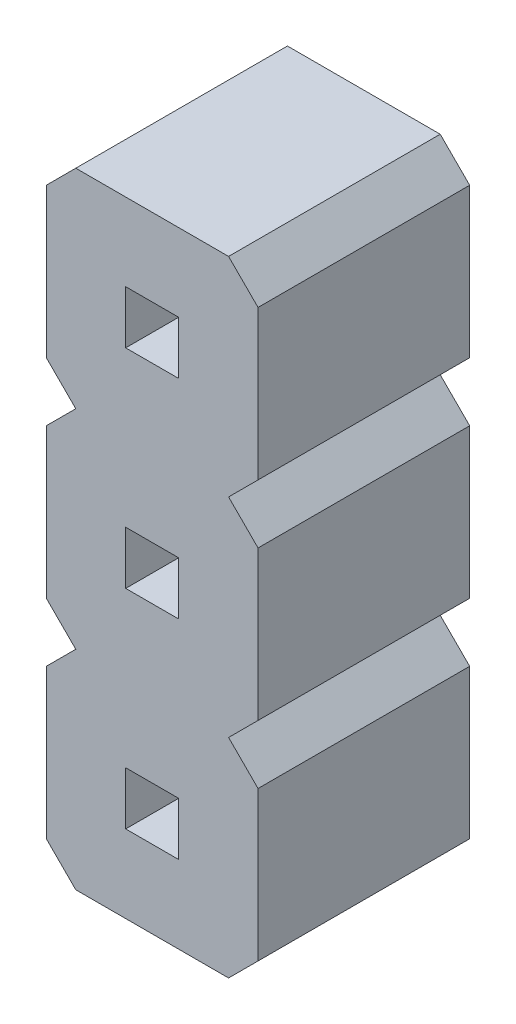
ISO-10303-21;
HEADER;
FILE_DESCRIPTION(('STEP AP214'),'2;1');
FILE_NAME('part.step','',(''),(''),'','','');
FILE_SCHEMA(('AUTOMOTIVE_DESIGN { 1 0 10303 214 1 1 1 1 }'));
ENDSEC;
DATA;
#1=APPLICATION_CONTEXT('core data for automotive mechanical design processes');
#2=APPLICATION_PROTOCOL_DEFINITION('international standard','automotive_design',2000,#1);
#3=PRODUCT_CONTEXT('',#1,'mechanical');
#4=PRODUCT('Part','Part','',(#3));
#5=PRODUCT_RELATED_PRODUCT_CATEGORY('part','',(#4));
#6=PRODUCT_DEFINITION_FORMATION('','',#4);
#7=PRODUCT_DEFINITION_CONTEXT('part definition',#1,'design');
#8=PRODUCT_DEFINITION('design','',#6,#7);
#9=PRODUCT_DEFINITION_SHAPE('','',#8);
#10=(LENGTH_UNIT() NAMED_UNIT(*) SI_UNIT(.MILLI.,.METRE.));
#11=(NAMED_UNIT(*) PLANE_ANGLE_UNIT() SI_UNIT($,.RADIAN.));
#12=(NAMED_UNIT(*) SI_UNIT($,.STERADIAN.) SOLID_ANGLE_UNIT());
#13=UNCERTAINTY_MEASURE_WITH_UNIT(LENGTH_MEASURE(1.E-05),#10,'distance_accuracy_value','');
#14=(GEOMETRIC_REPRESENTATION_CONTEXT(3) GLOBAL_UNCERTAINTY_ASSIGNED_CONTEXT((#13)) GLOBAL_UNIT_ASSIGNED_CONTEXT((#10,
#11,#12)) REPRESENTATION_CONTEXT('',''));
#15=CARTESIAN_POINT('',(0.,0.,0.));
#16=DIRECTION('',(0.,0.,1.));
#17=DIRECTION('',(1.,0.,0.));
#18=AXIS2_PLACEMENT_3D('',#15,#16,#17);
#19=CARTESIAN_POINT('',(0.,0.,2.54));
#20=DIRECTION('',(0.,0.,1.));
#21=DIRECTION('',(1.,0.,0.));
#22=AXIS2_PLACEMENT_3D('',#19,#20,#21);
#23=PLANE('',#22);
#24=DIRECTION('',(-0.707106781186543,-0.707106781186552,0.));
#25=VECTOR('',#24,1.);
#26=CARTESIAN_POINT('',(0.,-0.353553390593276,2.54));
#27=LINE('',#26,#25);
#28=CARTESIAN_POINT('',(0.353553390593274,0.,2.54));
#29=VERTEX_POINT('',#28);
#30=CARTESIAN_POINT('',(0.,-0.353553390593276,2.54));
#31=VERTEX_POINT('',#30);
#32=EDGE_CURVE('E340',#29,#31,#27,.T.);
#33=ORIENTED_EDGE('',*,*,#32,.T.);
#34=DIRECTION('',(0.,-1.,0.));
#35=VECTOR('',#34,1.);
#36=CARTESIAN_POINT('',(0.,-0.353553390593276,2.54));
#37=LINE('',#36,#35);
#38=CARTESIAN_POINT('',(0.,-2.14644660940673,2.54));
#39=VERTEX_POINT('',#38);
#40=EDGE_CURVE('E343',#31,#39,#37,.T.);
#41=ORIENTED_EDGE('',*,*,#40,.T.);
#42=DIRECTION('',(0.707106781186551,-0.707106781186544,0.));
#43=VECTOR('',#42,1.);
#44=CARTESIAN_POINT('',(0.353553390593274,-2.5,2.54));
#45=LINE('',#44,#43);
#46=CARTESIAN_POINT('',(0.353553390593274,-2.5,2.54));
#47=VERTEX_POINT('',#46);
#48=EDGE_CURVE('E346',#39,#47,#45,.T.);
#49=ORIENTED_EDGE('',*,*,#48,.T.);
#50=DIRECTION('',(1.,0.,0.));
#51=VECTOR('',#50,1.);
#52=CARTESIAN_POINT('',(2.18744660940673,-2.50000000000001,2.54));
#53=LINE('',#52,#51);
#54=CARTESIAN_POINT('',(2.18744660940673,-2.50000000000001,2.54));
#55=VERTEX_POINT('',#54);
#56=EDGE_CURVE('E348',#47,#55,#53,.T.);
#57=ORIENTED_EDGE('',*,*,#56,.T.);
#58=DIRECTION('',(0.707106781186548,0.707106781186547,0.));
#59=VECTOR('',#58,1.);
#60=CARTESIAN_POINT('',(2.54100000000001,-2.14644660940674,2.54));
#61=LINE('',#60,#59);
#62=CARTESIAN_POINT('',(2.54100000000001,-2.14644660940674,2.54));
#63=VERTEX_POINT('',#62);
#64=EDGE_CURVE('E350',#55,#63,#61,.T.);
#65=ORIENTED_EDGE('',*,*,#64,.T.);
#66=DIRECTION('',(0.,1.,0.));
#67=VECTOR('',#66,1.);
#68=CARTESIAN_POINT('',(2.541,-0.353553390593266,2.54));
#69=LINE('',#68,#67);
#70=CARTESIAN_POINT('',(2.541,-0.353553390593266,2.54));
#71=VERTEX_POINT('',#70);
#72=EDGE_CURVE('E352',#63,#71,#69,.T.);
#73=ORIENTED_EDGE('',*,*,#72,.T.);
#74=DIRECTION('',(-0.707106781186556,0.707106781186539,0.));
#75=VECTOR('',#74,1.);
#76=CARTESIAN_POINT('',(2.18744660940671,0.,2.54));
#77=LINE('',#76,#75);
#78=CARTESIAN_POINT('',(2.18744660940671,0.,2.54));
#79=VERTEX_POINT('',#78);
#80=EDGE_CURVE('E354',#71,#79,#77,.T.);
#81=ORIENTED_EDGE('',*,*,#80,.T.);
#82=DIRECTION('',(0.707106781186562,0.707106781186533,0.));
#83=VECTOR('',#82,1.);
#84=CARTESIAN_POINT('',(2.54099999999999,0.353553390593273,2.54));
#85=LINE('',#84,#83);
#86=CARTESIAN_POINT('',(2.54099999999999,0.353553390593273,2.54));
#87=VERTEX_POINT('',#86);
#88=EDGE_CURVE('E356',#79,#87,#85,.T.);
#89=ORIENTED_EDGE('',*,*,#88,.T.);
#90=DIRECTION('',(0.,1.,0.));
#91=VECTOR('',#90,1.);
#92=CARTESIAN_POINT('',(2.54099999999999,2.14644660940673,2.54));
#93=LINE('',#92,#91);
#94=CARTESIAN_POINT('',(2.54099999999999,2.14644660940673,2.54));
#95=VERTEX_POINT('',#94);
#96=EDGE_CURVE('E358',#87,#95,#93,.T.);
#97=ORIENTED_EDGE('',*,*,#96,.T.);
#98=DIRECTION('',(-0.707106781186556,0.707106781186539,0.));
#99=VECTOR('',#98,1.);
#100=CARTESIAN_POINT('',(2.18744660940672,2.5,2.54));
#101=LINE('',#100,#99);
#102=CARTESIAN_POINT('',(2.18744660940672,2.5,2.54));
#103=VERTEX_POINT('',#102);
#104=EDGE_CURVE('E360',#95,#103,#101,.T.);
#105=ORIENTED_EDGE('',*,*,#104,.T.);
#106=DIRECTION('',(0.70710678118654,0.707106781186555,0.));
#107=VECTOR('',#106,1.);
#108=CARTESIAN_POINT('',(2.54099999999998,2.85355339059327,2.54));
#109=LINE('',#108,#107);
#110=CARTESIAN_POINT('',(2.54099999999998,2.85355339059327,2.54));
#111=VERTEX_POINT('',#110);
#112=EDGE_CURVE('E362',#103,#111,#109,.T.);
#113=ORIENTED_EDGE('',*,*,#112,.T.);
#114=DIRECTION('',(0.,1.,0.));
#115=VECTOR('',#114,1.);
#116=CARTESIAN_POINT('',(2.54099999999998,4.64644660940673,2.54));
#117=LINE('',#116,#115);
#118=CARTESIAN_POINT('',(2.54099999999998,4.64644660940673,2.54));
#119=VERTEX_POINT('',#118);
#120=EDGE_CURVE('E364',#111,#119,#117,.T.);
#121=ORIENTED_EDGE('',*,*,#120,.T.);
#122=DIRECTION('',(-0.707106781186556,0.707106781186539,0.));
#123=VECTOR('',#122,1.);
#124=CARTESIAN_POINT('',(2.18744660940671,5.,2.54));
#125=LINE('',#124,#123);
#126=CARTESIAN_POINT('',(2.18744660940671,5.,2.54));
#127=VERTEX_POINT('',#126);
#128=EDGE_CURVE('E366',#119,#127,#125,.T.);
#129=ORIENTED_EDGE('',*,*,#128,.T.);
#130=DIRECTION('',(-1.,0.,0.));
#131=VECTOR('',#130,1.);
#132=CARTESIAN_POINT('',(0.353553390593254,5.,2.54));
#133=LINE('',#132,#131);
#134=CARTESIAN_POINT('',(0.353553390593254,5.,2.54));
#135=VERTEX_POINT('',#134);
#136=EDGE_CURVE('E368',#127,#135,#133,.T.);
#137=ORIENTED_EDGE('',*,*,#136,.T.);
#138=DIRECTION('',(-0.707106781186541,-0.707106781186554,0.));
#139=VECTOR('',#138,1.);
#140=CARTESIAN_POINT('',(0.,4.64644660940672,2.54));
#141=LINE('',#140,#139);
#142=CARTESIAN_POINT('',(0.,4.64644660940672,2.54));
#143=VERTEX_POINT('',#142);
#144=EDGE_CURVE('E370',#135,#143,#141,.T.);
#145=ORIENTED_EDGE('',*,*,#144,.T.);
#146=DIRECTION('',(0.,-1.,0.));
#147=VECTOR('',#146,1.);
#148=CARTESIAN_POINT('',(0.,4.64644660940672,2.54));
#149=LINE('',#148,#147);
#150=CARTESIAN_POINT('',(0.,2.85355339059327,2.54));
#151=VERTEX_POINT('',#150);
#152=EDGE_CURVE('E372',#143,#151,#149,.T.);
#153=ORIENTED_EDGE('',*,*,#152,.T.);
#154=DIRECTION('',(0.707106781186558,-0.707106781186537,0.));
#155=VECTOR('',#154,1.);
#156=CARTESIAN_POINT('',(0.353553390593263,2.5,2.54));
#157=LINE('',#156,#155);
#158=CARTESIAN_POINT('',(0.353553390593263,2.5,2.54));
#159=VERTEX_POINT('',#158);
#160=EDGE_CURVE('E374',#151,#159,#157,.T.);
#161=ORIENTED_EDGE('',*,*,#160,.T.);
#162=DIRECTION('',(-0.707106781186541,-0.707106781186554,0.));
#163=VECTOR('',#162,1.);
#164=CARTESIAN_POINT('',(0.,2.14644660940672,2.54));
#165=LINE('',#164,#163);
#166=CARTESIAN_POINT('',(0.,2.14644660940672,2.54));
#167=VERTEX_POINT('',#166);
#168=EDGE_CURVE('E376',#159,#167,#165,.T.);
#169=ORIENTED_EDGE('',*,*,#168,.T.);
#170=DIRECTION('',(0.,-1.,0.));
#171=VECTOR('',#170,1.);
#172=CARTESIAN_POINT('',(0.,2.14644660940672,2.54));
#173=LINE('',#172,#171);
#174=CARTESIAN_POINT('',(0.,0.35355339059327,2.54));
#175=VERTEX_POINT('',#174);
#176=EDGE_CURVE('E378',#167,#175,#173,.T.);
#177=ORIENTED_EDGE('',*,*,#176,.T.);
#178=DIRECTION('',(0.70710678118656,-0.707106781186535,0.));
#179=VECTOR('',#178,1.);
#180=CARTESIAN_POINT('',(0.353553390593274,0.,2.54));
#181=LINE('',#180,#179);
#182=EDGE_CURVE('E380',#175,#29,#181,.T.);
#183=ORIENTED_EDGE('',*,*,#182,.T.);
#184=EDGE_LOOP('',(#33,#41,#49,#57,#65,#73,#81,#89,#97,#105,#113,#121,#129,#137,#145,#153,#161,
#169,#177,#183));
#185=FACE_BOUND('',#184,.T.);
#186=DIRECTION('',(1.,0.,0.));
#187=VECTOR('',#186,1.);
#188=CARTESIAN_POINT('',(0.9525,-1.568,2.54));
#189=LINE('',#188,#187);
#190=CARTESIAN_POINT('',(0.9525,-1.568,2.54));
#191=VERTEX_POINT('',#190);
#192=CARTESIAN_POINT('',(1.5885,-1.568,2.54));
#193=VERTEX_POINT('',#192);
#194=EDGE_CURVE('E311',#191,#193,#189,.T.);
#195=ORIENTED_EDGE('',*,*,#194,.F.);
#196=DIRECTION('',(0.,-1.,0.));
#197=VECTOR('',#196,1.);
#198=CARTESIAN_POINT('',(0.9525,-0.932,2.54));
#199=LINE('',#198,#197);
#200=CARTESIAN_POINT('',(0.9525,-0.932,2.54));
#201=VERTEX_POINT('',#200);
#202=EDGE_CURVE('E309',#201,#191,#199,.T.);
#203=ORIENTED_EDGE('',*,*,#202,.F.);
#204=DIRECTION('',(-1.,0.,0.));
#205=VECTOR('',#204,1.);
#206=CARTESIAN_POINT('',(0.9525,-0.932,2.54));
#207=LINE('',#206,#205);
#208=CARTESIAN_POINT('',(1.5885,-0.932,2.54));
#209=VERTEX_POINT('',#208);
#210=EDGE_CURVE('E317',#209,#201,#207,.T.);
#211=ORIENTED_EDGE('',*,*,#210,.F.);
#212=DIRECTION('',(0.,1.,0.));
#213=VECTOR('',#212,1.);
#214=CARTESIAN_POINT('',(1.5885,-0.932,2.54));
#215=LINE('',#214,#213);
#216=EDGE_CURVE('E314',#193,#209,#215,.T.);
#217=ORIENTED_EDGE('',*,*,#216,.F.);
#218=EDGE_LOOP('',(#195,#203,#211,#217));
#219=FACE_BOUND('',#218,.T.);
#220=DIRECTION('',(1.,0.,0.));
#221=VECTOR('',#220,1.);
#222=CARTESIAN_POINT('',(0.952499999999992,0.932,2.54));
#223=LINE('',#222,#221);
#224=CARTESIAN_POINT('',(0.952499999999992,0.932,2.54));
#225=VERTEX_POINT('',#224);
#226=CARTESIAN_POINT('',(1.58849999999999,0.932,2.54));
#227=VERTEX_POINT('',#226);
#228=EDGE_CURVE('E280',#225,#227,#223,.T.);
#229=ORIENTED_EDGE('',*,*,#228,.F.);
#230=DIRECTION('',(0.,-1.,0.));
#231=VECTOR('',#230,1.);
#232=CARTESIAN_POINT('',(0.952499999999991,1.568,2.54));
#233=LINE('',#232,#231);
#234=CARTESIAN_POINT('',(0.952499999999991,1.568,2.54));
#235=VERTEX_POINT('',#234);
#236=EDGE_CURVE('E278',#235,#225,#233,.T.);
#237=ORIENTED_EDGE('',*,*,#236,.F.);
#238=DIRECTION('',(-1.,0.,0.));
#239=VECTOR('',#238,1.);
#240=CARTESIAN_POINT('',(0.952499999999991,1.568,2.54));
#241=LINE('',#240,#239);
#242=CARTESIAN_POINT('',(1.58849999999999,1.568,2.54));
#243=VERTEX_POINT('',#242);
#244=EDGE_CURVE('E286',#243,#235,#241,.T.);
#245=ORIENTED_EDGE('',*,*,#244,.F.);
#246=DIRECTION('',(0.,1.,0.));
#247=VECTOR('',#246,1.);
#248=CARTESIAN_POINT('',(1.58849999999999,1.568,2.54));
#249=LINE('',#248,#247);
#250=EDGE_CURVE('E283',#227,#243,#249,.T.);
#251=ORIENTED_EDGE('',*,*,#250,.F.);
#252=EDGE_LOOP('',(#229,#237,#245,#251));
#253=FACE_BOUND('',#252,.T.);
#254=DIRECTION('',(1.,0.,0.));
#255=VECTOR('',#254,1.);
#256=CARTESIAN_POINT('',(0.952499999999983,3.432,2.54));
#257=LINE('',#256,#255);
#258=CARTESIAN_POINT('',(0.952499999999983,3.432,2.54));
#259=VERTEX_POINT('',#258);
#260=CARTESIAN_POINT('',(1.58849999999998,3.432,2.54));
#261=VERTEX_POINT('',#260);
#262=EDGE_CURVE('E250',#259,#261,#257,.T.);
#263=ORIENTED_EDGE('',*,*,#262,.F.);
#264=DIRECTION('',(0.,-1.,0.));
#265=VECTOR('',#264,1.);
#266=CARTESIAN_POINT('',(0.952499999999983,4.068,2.54));
#267=LINE('',#266,#265);
#268=CARTESIAN_POINT('',(0.952499999999983,4.068,2.54));
#269=VERTEX_POINT('',#268);
#270=EDGE_CURVE('E242',#269,#259,#267,.T.);
#271=ORIENTED_EDGE('',*,*,#270,.F.);
#272=DIRECTION('',(-1.,0.,0.));
#273=VECTOR('',#272,1.);
#274=CARTESIAN_POINT('',(0.952499999999983,4.068,2.54));
#275=LINE('',#274,#273);
#276=CARTESIAN_POINT('',(1.58849999999998,4.068,2.54));
#277=VERTEX_POINT('',#276);
#278=EDGE_CURVE('E264',#277,#269,#275,.T.);
#279=ORIENTED_EDGE('',*,*,#278,.F.);
#280=DIRECTION('',(0.,1.,0.));
#281=VECTOR('',#280,1.);
#282=CARTESIAN_POINT('',(1.58849999999998,4.068,2.54));
#283=LINE('',#282,#281);
#284=EDGE_CURVE('E262',#261,#277,#283,.T.);
#285=ORIENTED_EDGE('',*,*,#284,.F.);
#286=EDGE_LOOP('',(#263,#271,#279,#285));
#287=FACE_BOUND('',#286,.T.);
#288=ADVANCED_FACE('F33',(#185,#219,#253,#287),#23,.T.);
#289=CARTESIAN_POINT('',(0.,0.,0.));
#290=DIRECTION('',(0.,0.,1.));
#291=DIRECTION('',(1.,0.,0.));
#292=AXIS2_PLACEMENT_3D('',#289,#290,#291);
#293=PLANE('',#292);
#294=DIRECTION('',(0.,-1.,0.));
#295=VECTOR('',#294,1.);
#296=CARTESIAN_POINT('',(0.952499999999991,1.568,0.));
#297=LINE('',#296,#295);
#298=CARTESIAN_POINT('',(0.952499999999991,1.568,0.));
#299=VERTEX_POINT('',#298);
#300=CARTESIAN_POINT('',(0.952499999999992,0.932,0.));
#301=VERTEX_POINT('',#300);
#302=EDGE_CURVE('E258',#299,#301,#297,.T.);
#303=ORIENTED_EDGE('',*,*,#302,.T.);
#304=DIRECTION('',(1.,0.,0.));
#305=VECTOR('',#304,1.);
#306=CARTESIAN_POINT('',(0.952499999999992,0.932,0.));
#307=LINE('',#306,#305);
#308=CARTESIAN_POINT('',(1.58849999999999,0.932,0.));
#309=VERTEX_POINT('',#308);
#310=EDGE_CURVE('E291',#301,#309,#307,.T.);
#311=ORIENTED_EDGE('',*,*,#310,.T.);
#312=DIRECTION('',(0.,1.,0.));
#313=VECTOR('',#312,1.);
#314=CARTESIAN_POINT('',(1.58849999999999,1.568,0.));
#315=LINE('',#314,#313);
#316=CARTESIAN_POINT('',(1.58849999999999,1.568,0.));
#317=VERTEX_POINT('',#316);
#318=EDGE_CURVE('E294',#309,#317,#315,.T.);
#319=ORIENTED_EDGE('',*,*,#318,.T.);
#320=DIRECTION('',(-1.,0.,0.));
#321=VECTOR('',#320,1.);
#322=CARTESIAN_POINT('',(0.952499999999991,1.568,0.));
#323=LINE('',#322,#321);
#324=EDGE_CURVE('E281',#317,#299,#323,.T.);
#325=ORIENTED_EDGE('',*,*,#324,.T.);
#326=EDGE_LOOP('',(#303,#311,#319,#325));
#327=FACE_BOUND('',#326,.T.);
#328=DIRECTION('',(-0.707106781186543,-0.707106781186552,0.));
#329=VECTOR('',#328,1.);
#330=CARTESIAN_POINT('',(0.,-0.353553390593276,0.));
#331=LINE('',#330,#329);
#332=CARTESIAN_POINT('',(0.353553390593274,0.,0.));
#333=VERTEX_POINT('',#332);
#334=CARTESIAN_POINT('',(0.,-0.353553390593276,0.));
#335=VERTEX_POINT('',#334);
#336=EDGE_CURVE('E339',#333,#335,#331,.T.);
#337=ORIENTED_EDGE('',*,*,#336,.F.);
#338=DIRECTION('',(0.70710678118656,-0.707106781186535,0.));
#339=VECTOR('',#338,1.);
#340=CARTESIAN_POINT('',(0.353553390593274,0.,0.));
#341=LINE('',#340,#339);
#342=CARTESIAN_POINT('',(0.,0.35355339059327,0.));
#343=VERTEX_POINT('',#342);
#344=EDGE_CURVE('E344',#343,#333,#341,.T.);
#345=ORIENTED_EDGE('',*,*,#344,.F.);
#346=DIRECTION('',(0.,-1.,0.));
#347=VECTOR('',#346,1.);
#348=CARTESIAN_POINT('',(0.,2.14644660940672,0.));
#349=LINE('',#348,#347);
#350=CARTESIAN_POINT('',(0.,2.14644660940672,0.));
#351=VERTEX_POINT('',#350);
#352=EDGE_CURVE('E419',#351,#343,#349,.T.);
#353=ORIENTED_EDGE('',*,*,#352,.F.);
#354=DIRECTION('',(-0.707106781186541,-0.707106781186554,0.));
#355=VECTOR('',#354,1.);
#356=CARTESIAN_POINT('',(0.,2.14644660940672,0.));
#357=LINE('',#356,#355);
#358=CARTESIAN_POINT('',(0.353553390593263,2.5,0.));
#359=VERTEX_POINT('',#358);
#360=EDGE_CURVE('E417',#359,#351,#357,.T.);
#361=ORIENTED_EDGE('',*,*,#360,.F.);
#362=DIRECTION('',(0.707106781186558,-0.707106781186537,0.));
#363=VECTOR('',#362,1.);
#364=CARTESIAN_POINT('',(0.353553390593263,2.5,0.));
#365=LINE('',#364,#363);
#366=CARTESIAN_POINT('',(0.,2.85355339059327,0.));
#367=VERTEX_POINT('',#366);
#368=EDGE_CURVE('E415',#367,#359,#365,.T.);
#369=ORIENTED_EDGE('',*,*,#368,.F.);
#370=DIRECTION('',(0.,-1.,0.));
#371=VECTOR('',#370,1.);
#372=CARTESIAN_POINT('',(0.,4.64644660940672,0.));
#373=LINE('',#372,#371);
#374=CARTESIAN_POINT('',(0.,4.64644660940672,0.));
#375=VERTEX_POINT('',#374);
#376=EDGE_CURVE('E413',#375,#367,#373,.T.);
#377=ORIENTED_EDGE('',*,*,#376,.F.);
#378=DIRECTION('',(-0.707106781186541,-0.707106781186554,0.));
#379=VECTOR('',#378,1.);
#380=CARTESIAN_POINT('',(0.,4.64644660940672,0.));
#381=LINE('',#380,#379);
#382=CARTESIAN_POINT('',(0.353553390593254,5.,0.));
#383=VERTEX_POINT('',#382);
#384=EDGE_CURVE('E411',#383,#375,#381,.T.);
#385=ORIENTED_EDGE('',*,*,#384,.F.);
#386=DIRECTION('',(-1.,0.,0.));
#387=VECTOR('',#386,1.);
#388=CARTESIAN_POINT('',(0.353553390593254,5.,0.));
#389=LINE('',#388,#387);
#390=CARTESIAN_POINT('',(2.18744660940671,5.,0.));
#391=VERTEX_POINT('',#390);
#392=EDGE_CURVE('E409',#391,#383,#389,.T.);
#393=ORIENTED_EDGE('',*,*,#392,.F.);
#394=DIRECTION('',(-0.707106781186556,0.707106781186539,0.));
#395=VECTOR('',#394,1.);
#396=CARTESIAN_POINT('',(2.18744660940671,5.,0.));
#397=LINE('',#396,#395);
#398=CARTESIAN_POINT('',(2.54099999999998,4.64644660940673,0.));
#399=VERTEX_POINT('',#398);
#400=EDGE_CURVE('E407',#399,#391,#397,.T.);
#401=ORIENTED_EDGE('',*,*,#400,.F.);
#402=DIRECTION('',(0.,1.,0.));
#403=VECTOR('',#402,1.);
#404=CARTESIAN_POINT('',(2.54099999999998,4.64644660940673,0.));
#405=LINE('',#404,#403);
#406=CARTESIAN_POINT('',(2.54099999999998,2.85355339059327,0.));
#407=VERTEX_POINT('',#406);
#408=EDGE_CURVE('E405',#407,#399,#405,.T.);
#409=ORIENTED_EDGE('',*,*,#408,.F.);
#410=DIRECTION('',(0.70710678118654,0.707106781186555,0.));
#411=VECTOR('',#410,1.);
#412=CARTESIAN_POINT('',(2.54099999999998,2.85355339059327,0.));
#413=LINE('',#412,#411);
#414=CARTESIAN_POINT('',(2.18744660940672,2.5,0.));
#415=VERTEX_POINT('',#414);
#416=EDGE_CURVE('E403',#415,#407,#413,.T.);
#417=ORIENTED_EDGE('',*,*,#416,.F.);
#418=DIRECTION('',(-0.707106781186556,0.707106781186539,0.));
#419=VECTOR('',#418,1.);
#420=CARTESIAN_POINT('',(2.18744660940672,2.5,0.));
#421=LINE('',#420,#419);
#422=CARTESIAN_POINT('',(2.54099999999999,2.14644660940673,0.));
#423=VERTEX_POINT('',#422);
#424=EDGE_CURVE('E401',#423,#415,#421,.T.);
#425=ORIENTED_EDGE('',*,*,#424,.F.);
#426=DIRECTION('',(0.,1.,0.));
#427=VECTOR('',#426,1.);
#428=CARTESIAN_POINT('',(2.54099999999999,2.14644660940673,0.));
#429=LINE('',#428,#427);
#430=CARTESIAN_POINT('',(2.54099999999999,0.353553390593273,0.));
#431=VERTEX_POINT('',#430);
#432=EDGE_CURVE('E399',#431,#423,#429,.T.);
#433=ORIENTED_EDGE('',*,*,#432,.F.);
#434=DIRECTION('',(0.707106781186562,0.707106781186533,0.));
#435=VECTOR('',#434,1.);
#436=CARTESIAN_POINT('',(2.54099999999999,0.353553390593273,0.));
#437=LINE('',#436,#435);
#438=CARTESIAN_POINT('',(2.18744660940671,0.,0.));
#439=VERTEX_POINT('',#438);
#440=EDGE_CURVE('E397',#439,#431,#437,.T.);
#441=ORIENTED_EDGE('',*,*,#440,.F.);
#442=DIRECTION('',(-0.707106781186556,0.707106781186539,0.));
#443=VECTOR('',#442,1.);
#444=CARTESIAN_POINT('',(2.18744660940671,0.,0.));
#445=LINE('',#444,#443);
#446=CARTESIAN_POINT('',(2.541,-0.353553390593266,0.));
#447=VERTEX_POINT('',#446);
#448=EDGE_CURVE('E395',#447,#439,#445,.T.);
#449=ORIENTED_EDGE('',*,*,#448,.F.);
#450=DIRECTION('',(0.,1.,0.));
#451=VECTOR('',#450,1.);
#452=CARTESIAN_POINT('',(2.541,-0.353553390593266,0.));
#453=LINE('',#452,#451);
#454=CARTESIAN_POINT('',(2.54100000000001,-2.14644660940674,0.));
#455=VERTEX_POINT('',#454);
#456=EDGE_CURVE('E393',#455,#447,#453,.T.);
#457=ORIENTED_EDGE('',*,*,#456,.F.);
#458=DIRECTION('',(0.707106781186548,0.707106781186547,0.));
#459=VECTOR('',#458,1.);
#460=CARTESIAN_POINT('',(2.54100000000001,-2.14644660940674,0.));
#461=LINE('',#460,#459);
#462=CARTESIAN_POINT('',(2.18744660940673,-2.50000000000001,0.));
#463=VERTEX_POINT('',#462);
#464=EDGE_CURVE('E391',#463,#455,#461,.T.);
#465=ORIENTED_EDGE('',*,*,#464,.F.);
#466=DIRECTION('',(1.,0.,0.));
#467=VECTOR('',#466,1.);
#468=CARTESIAN_POINT('',(2.18744660940673,-2.50000000000001,0.));
#469=LINE('',#468,#467);
#470=CARTESIAN_POINT('',(0.353553390593274,-2.5,0.));
#471=VERTEX_POINT('',#470);
#472=EDGE_CURVE('E389',#471,#463,#469,.T.);
#473=ORIENTED_EDGE('',*,*,#472,.F.);
#474=DIRECTION('',(0.707106781186551,-0.707106781186544,0.));
#475=VECTOR('',#474,1.);
#476=CARTESIAN_POINT('',(0.353553390593274,-2.5,0.));
#477=LINE('',#476,#475);
#478=CARTESIAN_POINT('',(0.,-2.14644660940673,0.));
#479=VERTEX_POINT('',#478);
#480=EDGE_CURVE('E387',#479,#471,#477,.T.);
#481=ORIENTED_EDGE('',*,*,#480,.F.);
#482=DIRECTION('',(0.,-1.,0.));
#483=VECTOR('',#482,1.);
#484=CARTESIAN_POINT('',(0.,-0.353553390593276,0.));
#485=LINE('',#484,#483);
#486=EDGE_CURVE('E385',#335,#479,#485,.T.);
#487=ORIENTED_EDGE('',*,*,#486,.F.);
#488=EDGE_LOOP('',(#337,#345,#353,#361,#369,#377,#385,#393,#401,#409,#417,#425,#433,#441,#449,
#457,#465,#473,#481,#487));
#489=FACE_BOUND('',#488,.T.);
#490=DIRECTION('',(0.,-1.,0.));
#491=VECTOR('',#490,1.);
#492=CARTESIAN_POINT('',(0.9525,-0.932,0.));
#493=LINE('',#492,#491);
#494=CARTESIAN_POINT('',(0.9525,-0.932,0.));
#495=VERTEX_POINT('',#494);
#496=CARTESIAN_POINT('',(0.9525,-1.568,0.));
#497=VERTEX_POINT('',#496);
#498=EDGE_CURVE('E308',#495,#497,#493,.T.);
#499=ORIENTED_EDGE('',*,*,#498,.T.);
#500=DIRECTION('',(1.,0.,0.));
#501=VECTOR('',#500,1.);
#502=CARTESIAN_POINT('',(0.9525,-1.568,0.));
#503=LINE('',#502,#501);
#504=CARTESIAN_POINT('',(1.5885,-1.568,0.));
#505=VERTEX_POINT('',#504);
#506=EDGE_CURVE('E322',#497,#505,#503,.T.);
#507=ORIENTED_EDGE('',*,*,#506,.T.);
#508=DIRECTION('',(0.,1.,0.));
#509=VECTOR('',#508,1.);
#510=CARTESIAN_POINT('',(1.5885,-0.932,0.));
#511=LINE('',#510,#509);
#512=CARTESIAN_POINT('',(1.5885,-0.932,0.));
#513=VERTEX_POINT('',#512);
#514=EDGE_CURVE('E325',#505,#513,#511,.T.);
#515=ORIENTED_EDGE('',*,*,#514,.T.);
#516=DIRECTION('',(-1.,0.,0.));
#517=VECTOR('',#516,1.);
#518=CARTESIAN_POINT('',(0.9525,-0.932,0.));
#519=LINE('',#518,#517);
#520=EDGE_CURVE('E312',#513,#495,#519,.T.);
#521=ORIENTED_EDGE('',*,*,#520,.T.);
#522=EDGE_LOOP('',(#499,#507,#515,#521));
#523=FACE_BOUND('',#522,.T.);
#524=DIRECTION('',(0.,-1.,0.));
#525=VECTOR('',#524,1.);
#526=CARTESIAN_POINT('',(0.952499999999983,4.068,0.));
#527=LINE('',#526,#525);
#528=CARTESIAN_POINT('',(0.952499999999983,4.068,0.));
#529=VERTEX_POINT('',#528);
#530=CARTESIAN_POINT('',(0.952499999999983,3.432,0.));
#531=VERTEX_POINT('',#530);
#532=EDGE_CURVE('E56',#529,#531,#527,.T.);
#533=ORIENTED_EDGE('',*,*,#532,.T.);
#534=DIRECTION('',(1.,0.,0.));
#535=VECTOR('',#534,1.);
#536=CARTESIAN_POINT('',(0.952499999999983,3.432,0.));
#537=LINE('',#536,#535);
#538=CARTESIAN_POINT('',(1.58849999999998,3.432,0.));
#539=VERTEX_POINT('',#538);
#540=EDGE_CURVE('E257',#531,#539,#537,.T.);
#541=ORIENTED_EDGE('',*,*,#540,.T.);
#542=DIRECTION('',(0.,1.,0.));
#543=VECTOR('',#542,1.);
#544=CARTESIAN_POINT('',(1.58849999999998,4.068,0.));
#545=LINE('',#544,#543);
#546=CARTESIAN_POINT('',(1.58849999999998,4.068,0.));
#547=VERTEX_POINT('',#546);
#548=EDGE_CURVE('E270',#539,#547,#545,.T.);
#549=ORIENTED_EDGE('',*,*,#548,.T.);
#550=DIRECTION('',(-1.,0.,0.));
#551=VECTOR('',#550,1.);
#552=CARTESIAN_POINT('',(0.952499999999983,4.068,0.));
#553=LINE('',#552,#551);
#554=EDGE_CURVE('E251',#547,#529,#553,.T.);
#555=ORIENTED_EDGE('',*,*,#554,.T.);
#556=EDGE_LOOP('',(#533,#541,#549,#555));
#557=FACE_BOUND('',#556,.T.);
#558=ADVANCED_FACE('F485',(#327,#489,#523,#557),#293,.F.);
#559=CARTESIAN_POINT('',(0.,-0.353553390593276,2.54));
#560=DIRECTION('',(0.707106781186552,-0.707106781186543,0.));
#561=DIRECTION('',(0.707106781186543,0.707106781186552,0.));
#562=AXIS2_PLACEMENT_3D('',#559,#560,#561);
#563=PLANE('',#562);
#564=ORIENTED_EDGE('',*,*,#336,.T.);
#565=DIRECTION('',(0.,0.,-1.));
#566=VECTOR('',#565,1.);
#567=CARTESIAN_POINT('',(0.,-0.353553390593276,2.54));
#568=LINE('',#567,#566);
#569=EDGE_CURVE('E11',#31,#335,#568,.T.);
#570=ORIENTED_EDGE('',*,*,#569,.F.);
#571=ORIENTED_EDGE('',*,*,#32,.F.);
#572=DIRECTION('',(0.,0.,-1.));
#573=VECTOR('',#572,1.);
#574=CARTESIAN_POINT('',(0.353553390593274,0.,2.54));
#575=LINE('',#574,#573);
#576=EDGE_CURVE('E382',#29,#333,#575,.T.);
#577=ORIENTED_EDGE('',*,*,#576,.T.);
#578=EDGE_LOOP('',(#564,#570,#571,#577));
#579=FACE_BOUND('',#578,.T.);
#580=ADVANCED_FACE('F35',(#579),#563,.F.);
#581=CARTESIAN_POINT('',(0.,-0.353553390593276,2.54));
#582=DIRECTION('',(1.,0.,0.));
#583=DIRECTION('',(0.,1.,0.));
#584=AXIS2_PLACEMENT_3D('',#581,#582,#583);
#585=PLANE('',#584);
#586=ORIENTED_EDGE('',*,*,#486,.T.);
#587=DIRECTION('',(0.,0.,-1.));
#588=VECTOR('',#587,1.);
#589=CARTESIAN_POINT('',(0.,-2.14644660940673,2.54));
#590=LINE('',#589,#588);
#591=EDGE_CURVE('E41',#39,#479,#590,.T.);
#592=ORIENTED_EDGE('',*,*,#591,.F.);
#593=ORIENTED_EDGE('',*,*,#40,.F.);
#594=ORIENTED_EDGE('',*,*,#569,.T.);
#595=EDGE_LOOP('',(#586,#592,#593,#594));
#596=FACE_BOUND('',#595,.T.);
#597=ADVANCED_FACE('F503',(#596),#585,.F.);
#598=CARTESIAN_POINT('',(0.353553390593274,-2.5,2.54));
#599=DIRECTION('',(0.707106781186544,0.707106781186551,0.));
#600=DIRECTION('',(-0.707106781186551,0.707106781186544,0.));
#601=AXIS2_PLACEMENT_3D('',#598,#599,#600);
#602=PLANE('',#601);
#603=ORIENTED_EDGE('',*,*,#480,.T.);
#604=DIRECTION('',(0.,0.,-1.));
#605=VECTOR('',#604,1.);
#606=CARTESIAN_POINT('',(0.353553390593274,-2.5,2.54));
#607=LINE('',#606,#605);
#608=EDGE_CURVE('E472',#47,#471,#607,.T.);
#609=ORIENTED_EDGE('',*,*,#608,.F.);
#610=ORIENTED_EDGE('',*,*,#48,.F.);
#611=ORIENTED_EDGE('',*,*,#591,.T.);
#612=EDGE_LOOP('',(#603,#609,#610,#611));
#613=FACE_BOUND('',#612,.T.);
#614=ADVANCED_FACE('F479',(#613),#602,.F.);
#615=CARTESIAN_POINT('',(2.18744660940673,-2.50000000000001,2.54));
#616=DIRECTION('',(0.,1.,0.));
#617=DIRECTION('',(-1.,0.,0.));
#618=AXIS2_PLACEMENT_3D('',#615,#616,#617);
#619=PLANE('',#618);
#620=ORIENTED_EDGE('',*,*,#472,.T.);
#621=DIRECTION('',(0.,0.,-1.));
#622=VECTOR('',#621,1.);
#623=CARTESIAN_POINT('',(2.18744660940673,-2.50000000000001,2.54));
#624=LINE('',#623,#622);
#625=EDGE_CURVE('E469',#55,#463,#624,.T.);
#626=ORIENTED_EDGE('',*,*,#625,.F.);
#627=ORIENTED_EDGE('',*,*,#56,.F.);
#628=ORIENTED_EDGE('',*,*,#608,.T.);
#629=EDGE_LOOP('',(#620,#626,#627,#628));
#630=FACE_BOUND('',#629,.T.);
#631=ADVANCED_FACE('F491',(#630),#619,.F.);
#632=CARTESIAN_POINT('',(2.54100000000001,-2.14644660940674,2.54));
#633=DIRECTION('',(-0.707106781186547,0.707106781186548,0.));
#634=DIRECTION('',(-0.707106781186548,-0.707106781186547,0.));
#635=AXIS2_PLACEMENT_3D('',#632,#633,#634);
#636=PLANE('',#635);
#637=ORIENTED_EDGE('',*,*,#464,.T.);
#638=DIRECTION('',(0.,0.,-1.));
#639=VECTOR('',#638,1.);
#640=CARTESIAN_POINT('',(2.54100000000001,-2.14644660940674,2.54));
#641=LINE('',#640,#639);
#642=EDGE_CURVE('E466',#63,#455,#641,.T.);
#643=ORIENTED_EDGE('',*,*,#642,.F.);
#644=ORIENTED_EDGE('',*,*,#64,.F.);
#645=ORIENTED_EDGE('',*,*,#625,.T.);
#646=EDGE_LOOP('',(#637,#643,#644,#645));
#647=FACE_BOUND('',#646,.T.);
#648=ADVANCED_FACE('F495',(#647),#636,.F.);
#649=CARTESIAN_POINT('',(2.541,-0.353553390593266,2.54));
#650=DIRECTION('',(-1.,0.,0.));
#651=DIRECTION('',(0.,-1.,0.));
#652=AXIS2_PLACEMENT_3D('',#649,#650,#651);
#653=PLANE('',#652);
#654=ORIENTED_EDGE('',*,*,#456,.T.);
#655=DIRECTION('',(0.,0.,-1.));
#656=VECTOR('',#655,1.);
#657=CARTESIAN_POINT('',(2.541,-0.353553390593266,2.54));
#658=LINE('',#657,#656);
#659=EDGE_CURVE('E463',#71,#447,#658,.T.);
#660=ORIENTED_EDGE('',*,*,#659,.F.);
#661=ORIENTED_EDGE('',*,*,#72,.F.);
#662=ORIENTED_EDGE('',*,*,#642,.T.);
#663=EDGE_LOOP('',(#654,#660,#661,#662));
#664=FACE_BOUND('',#663,.T.);
#665=ADVANCED_FACE('F576',(#664),#653,.F.);
#666=CARTESIAN_POINT('',(2.18744660940671,0.,2.54));
#667=DIRECTION('',(-0.707106781186539,-0.707106781186556,0.));
#668=DIRECTION('',(0.707106781186556,-0.707106781186539,0.));
#669=AXIS2_PLACEMENT_3D('',#666,#667,#668);
#670=PLANE('',#669);
#671=ORIENTED_EDGE('',*,*,#448,.T.);
#672=DIRECTION('',(0.,0.,-1.));
#673=VECTOR('',#672,1.);
#674=CARTESIAN_POINT('',(2.18744660940671,0.,2.54));
#675=LINE('',#674,#673);
#676=EDGE_CURVE('E460',#79,#439,#675,.T.);
#677=ORIENTED_EDGE('',*,*,#676,.F.);
#678=ORIENTED_EDGE('',*,*,#80,.F.);
#679=ORIENTED_EDGE('',*,*,#659,.T.);
#680=EDGE_LOOP('',(#671,#677,#678,#679));
#681=FACE_BOUND('',#680,.T.);
#682=ADVANCED_FACE('F574',(#681),#670,.F.);
#683=CARTESIAN_POINT('',(2.54099999999999,0.353553390593273,2.54));
#684=DIRECTION('',(-0.707106781186533,0.707106781186562,0.));
#685=DIRECTION('',(-0.707106781186562,-0.707106781186533,0.));
#686=AXIS2_PLACEMENT_3D('',#683,#684,#685);
#687=PLANE('',#686);
#688=ORIENTED_EDGE('',*,*,#440,.T.);
#689=DIRECTION('',(0.,0.,-1.));
#690=VECTOR('',#689,1.);
#691=CARTESIAN_POINT('',(2.54099999999999,0.353553390593273,2.54));
#692=LINE('',#691,#690);
#693=EDGE_CURVE('E457',#87,#431,#692,.T.);
#694=ORIENTED_EDGE('',*,*,#693,.F.);
#695=ORIENTED_EDGE('',*,*,#88,.F.);
#696=ORIENTED_EDGE('',*,*,#676,.T.);
#697=EDGE_LOOP('',(#688,#694,#695,#696));
#698=FACE_BOUND('',#697,.T.);
#699=ADVANCED_FACE('F569',(#698),#687,.F.);
#700=CARTESIAN_POINT('',(2.54099999999999,2.14644660940673,2.54));
#701=DIRECTION('',(-1.,0.,0.));
#702=DIRECTION('',(0.,-1.,0.));
#703=AXIS2_PLACEMENT_3D('',#700,#701,#702);
#704=PLANE('',#703);
#705=ORIENTED_EDGE('',*,*,#432,.T.);
#706=DIRECTION('',(0.,0.,-1.));
#707=VECTOR('',#706,1.);
#708=CARTESIAN_POINT('',(2.54099999999999,2.14644660940673,2.54));
#709=LINE('',#708,#707);
#710=EDGE_CURVE('E454',#95,#423,#709,.T.);
#711=ORIENTED_EDGE('',*,*,#710,.F.);
#712=ORIENTED_EDGE('',*,*,#96,.F.);
#713=ORIENTED_EDGE('',*,*,#693,.T.);
#714=EDGE_LOOP('',(#705,#711,#712,#713));
#715=FACE_BOUND('',#714,.T.);
#716=ADVANCED_FACE('F564',(#715),#704,.F.);
#717=CARTESIAN_POINT('',(2.18744660940672,2.5,2.54));
#718=DIRECTION('',(-0.707106781186539,-0.707106781186556,0.));
#719=DIRECTION('',(0.707106781186556,-0.707106781186539,0.));
#720=AXIS2_PLACEMENT_3D('',#717,#718,#719);
#721=PLANE('',#720);
#722=ORIENTED_EDGE('',*,*,#424,.T.);
#723=DIRECTION('',(0.,0.,-1.));
#724=VECTOR('',#723,1.);
#725=CARTESIAN_POINT('',(2.18744660940672,2.5,2.54));
#726=LINE('',#725,#724);
#727=EDGE_CURVE('E451',#103,#415,#726,.T.);
#728=ORIENTED_EDGE('',*,*,#727,.F.);
#729=ORIENTED_EDGE('',*,*,#104,.F.);
#730=ORIENTED_EDGE('',*,*,#710,.T.);
#731=EDGE_LOOP('',(#722,#728,#729,#730));
#732=FACE_BOUND('',#731,.T.);
#733=ADVANCED_FACE('F560',(#732),#721,.F.);
#734=CARTESIAN_POINT('',(2.54099999999998,2.85355339059327,2.54));
#735=DIRECTION('',(-0.707106781186555,0.70710678118654,0.));
#736=DIRECTION('',(-0.70710678118654,-0.707106781186555,0.));
#737=AXIS2_PLACEMENT_3D('',#734,#735,#736);
#738=PLANE('',#737);
#739=ORIENTED_EDGE('',*,*,#416,.T.);
#740=DIRECTION('',(0.,0.,-1.));
#741=VECTOR('',#740,1.);
#742=CARTESIAN_POINT('',(2.54099999999998,2.85355339059327,2.54));
#743=LINE('',#742,#741);
#744=EDGE_CURVE('E448',#111,#407,#743,.T.);
#745=ORIENTED_EDGE('',*,*,#744,.F.);
#746=ORIENTED_EDGE('',*,*,#112,.F.);
#747=ORIENTED_EDGE('',*,*,#727,.T.);
#748=EDGE_LOOP('',(#739,#745,#746,#747));
#749=FACE_BOUND('',#748,.T.);
#750=ADVANCED_FACE('F555',(#749),#738,.F.);
#751=CARTESIAN_POINT('',(2.54099999999998,4.64644660940673,2.54));
#752=DIRECTION('',(-1.,0.,0.));
#753=DIRECTION('',(0.,-1.,0.));
#754=AXIS2_PLACEMENT_3D('',#751,#752,#753);
#755=PLANE('',#754);
#756=ORIENTED_EDGE('',*,*,#408,.T.);
#757=DIRECTION('',(0.,0.,-1.));
#758=VECTOR('',#757,1.);
#759=CARTESIAN_POINT('',(2.54099999999998,4.64644660940673,2.54));
#760=LINE('',#759,#758);
#761=EDGE_CURVE('E445',#119,#399,#760,.T.);
#762=ORIENTED_EDGE('',*,*,#761,.F.);
#763=ORIENTED_EDGE('',*,*,#120,.F.);
#764=ORIENTED_EDGE('',*,*,#744,.T.);
#765=EDGE_LOOP('',(#756,#762,#763,#764));
#766=FACE_BOUND('',#765,.T.);
#767=ADVANCED_FACE('F549',(#766),#755,.F.);
#768=CARTESIAN_POINT('',(2.18744660940671,5.,2.54));
#769=DIRECTION('',(-0.707106781186539,-0.707106781186556,0.));
#770=DIRECTION('',(0.707106781186556,-0.707106781186539,0.));
#771=AXIS2_PLACEMENT_3D('',#768,#769,#770);
#772=PLANE('',#771);
#773=ORIENTED_EDGE('',*,*,#400,.T.);
#774=DIRECTION('',(0.,0.,-1.));
#775=VECTOR('',#774,1.);
#776=CARTESIAN_POINT('',(2.18744660940671,5.,2.54));
#777=LINE('',#776,#775);
#778=EDGE_CURVE('E442',#127,#391,#777,.T.);
#779=ORIENTED_EDGE('',*,*,#778,.F.);
#780=ORIENTED_EDGE('',*,*,#128,.F.);
#781=ORIENTED_EDGE('',*,*,#761,.T.);
#782=EDGE_LOOP('',(#773,#779,#780,#781));
#783=FACE_BOUND('',#782,.T.);
#784=ADVANCED_FACE('F545',(#783),#772,.F.);
#785=CARTESIAN_POINT('',(0.353553390593254,5.,2.54));
#786=DIRECTION('',(0.,-1.,0.));
#787=DIRECTION('',(0.,0.,-1.));
#788=AXIS2_PLACEMENT_3D('',#785,#786,#787);
#789=PLANE('',#788);
#790=ORIENTED_EDGE('',*,*,#392,.T.);
#791=DIRECTION('',(0.,0.,-1.));
#792=VECTOR('',#791,1.);
#793=CARTESIAN_POINT('',(0.353553390593254,5.,2.54));
#794=LINE('',#793,#792);
#795=EDGE_CURVE('E439',#135,#383,#794,.T.);
#796=ORIENTED_EDGE('',*,*,#795,.F.);
#797=ORIENTED_EDGE('',*,*,#136,.F.);
#798=ORIENTED_EDGE('',*,*,#778,.T.);
#799=EDGE_LOOP('',(#790,#796,#797,#798));
#800=FACE_BOUND('',#799,.T.);
#801=ADVANCED_FACE('F540',(#800),#789,.F.);
#802=CARTESIAN_POINT('',(0.,4.64644660940672,2.54));
#803=DIRECTION('',(0.707106781186554,-0.707106781186541,0.));
#804=DIRECTION('',(0.707106781186541,0.707106781186554,0.));
#805=AXIS2_PLACEMENT_3D('',#802,#803,#804);
#806=PLANE('',#805);
#807=ORIENTED_EDGE('',*,*,#384,.T.);
#808=DIRECTION('',(0.,0.,-1.));
#809=VECTOR('',#808,1.);
#810=CARTESIAN_POINT('',(0.,4.64644660940672,2.54));
#811=LINE('',#810,#809);
#812=EDGE_CURVE('E436',#143,#375,#811,.T.);
#813=ORIENTED_EDGE('',*,*,#812,.F.);
#814=ORIENTED_EDGE('',*,*,#144,.F.);
#815=ORIENTED_EDGE('',*,*,#795,.T.);
#816=EDGE_LOOP('',(#807,#813,#814,#815));
#817=FACE_BOUND('',#816,.T.);
#818=ADVANCED_FACE('F534',(#817),#806,.F.);
#819=CARTESIAN_POINT('',(0.,4.64644660940672,2.54));
#820=DIRECTION('',(1.,0.,0.));
#821=DIRECTION('',(0.,1.,0.));
#822=AXIS2_PLACEMENT_3D('',#819,#820,#821);
#823=PLANE('',#822);
#824=ORIENTED_EDGE('',*,*,#376,.T.);
#825=DIRECTION('',(0.,0.,-1.));
#826=VECTOR('',#825,1.);
#827=CARTESIAN_POINT('',(0.,2.85355339059327,2.54));
#828=LINE('',#827,#826);
#829=EDGE_CURVE('E433',#151,#367,#828,.T.);
#830=ORIENTED_EDGE('',*,*,#829,.F.);
#831=ORIENTED_EDGE('',*,*,#152,.F.);
#832=ORIENTED_EDGE('',*,*,#812,.T.);
#833=EDGE_LOOP('',(#824,#830,#831,#832));
#834=FACE_BOUND('',#833,.T.);
#835=ADVANCED_FACE('F530',(#834),#823,.F.);
#836=CARTESIAN_POINT('',(0.353553390593263,2.5,2.54));
#837=DIRECTION('',(0.707106781186537,0.707106781186558,0.));
#838=DIRECTION('',(-0.707106781186558,0.707106781186537,0.));
#839=AXIS2_PLACEMENT_3D('',#836,#837,#838);
#840=PLANE('',#839);
#841=ORIENTED_EDGE('',*,*,#368,.T.);
#842=DIRECTION('',(0.,0.,-1.));
#843=VECTOR('',#842,1.);
#844=CARTESIAN_POINT('',(0.353553390593263,2.5,2.54));
#845=LINE('',#844,#843);
#846=EDGE_CURVE('E430',#159,#359,#845,.T.);
#847=ORIENTED_EDGE('',*,*,#846,.F.);
#848=ORIENTED_EDGE('',*,*,#160,.F.);
#849=ORIENTED_EDGE('',*,*,#829,.T.);
#850=EDGE_LOOP('',(#841,#847,#848,#849));
#851=FACE_BOUND('',#850,.T.);
#852=ADVANCED_FACE('F525',(#851),#840,.F.);
#853=CARTESIAN_POINT('',(0.,2.14644660940672,2.54));
#854=DIRECTION('',(0.707106781186554,-0.707106781186541,0.));
#855=DIRECTION('',(0.707106781186541,0.707106781186554,0.));
#856=AXIS2_PLACEMENT_3D('',#853,#854,#855);
#857=PLANE('',#856);
#858=ORIENTED_EDGE('',*,*,#360,.T.);
#859=DIRECTION('',(0.,0.,-1.));
#860=VECTOR('',#859,1.);
#861=CARTESIAN_POINT('',(0.,2.14644660940672,2.54));
#862=LINE('',#861,#860);
#863=EDGE_CURVE('E427',#167,#351,#862,.T.);
#864=ORIENTED_EDGE('',*,*,#863,.F.);
#865=ORIENTED_EDGE('',*,*,#168,.F.);
#866=ORIENTED_EDGE('',*,*,#846,.T.);
#867=EDGE_LOOP('',(#858,#864,#865,#866));
#868=FACE_BOUND('',#867,.T.);
#869=ADVANCED_FACE('F519',(#868),#857,.F.);
#870=CARTESIAN_POINT('',(0.,2.14644660940672,2.54));
#871=DIRECTION('',(1.,0.,0.));
#872=DIRECTION('',(0.,1.,0.));
#873=AXIS2_PLACEMENT_3D('',#870,#871,#872);
#874=PLANE('',#873);
#875=ORIENTED_EDGE('',*,*,#352,.T.);
#876=DIRECTION('',(0.,0.,-1.));
#877=VECTOR('',#876,1.);
#878=CARTESIAN_POINT('',(0.,0.35355339059327,2.54));
#879=LINE('',#878,#877);
#880=EDGE_CURVE('E424',#175,#343,#879,.T.);
#881=ORIENTED_EDGE('',*,*,#880,.F.);
#882=ORIENTED_EDGE('',*,*,#176,.F.);
#883=ORIENTED_EDGE('',*,*,#863,.T.);
#884=EDGE_LOOP('',(#875,#881,#882,#883));
#885=FACE_BOUND('',#884,.T.);
#886=ADVANCED_FACE('F515',(#885),#874,.F.);
#887=CARTESIAN_POINT('',(0.353553390593274,0.,2.54));
#888=DIRECTION('',(0.707106781186535,0.70710678118656,0.));
#889=DIRECTION('',(-0.70710678118656,0.707106781186535,0.));
#890=AXIS2_PLACEMENT_3D('',#887,#888,#889);
#891=PLANE('',#890);
#892=ORIENTED_EDGE('',*,*,#344,.T.);
#893=ORIENTED_EDGE('',*,*,#576,.F.);
#894=ORIENTED_EDGE('',*,*,#182,.F.);
#895=ORIENTED_EDGE('',*,*,#880,.T.);
#896=EDGE_LOOP('',(#892,#893,#894,#895));
#897=FACE_BOUND('',#896,.T.);
#898=ADVANCED_FACE('F510',(#897),#891,.F.);
#899=CARTESIAN_POINT('',(0.9525,-0.932,2.54));
#900=DIRECTION('',(1.,0.,0.));
#901=DIRECTION('',(0.,1.,0.));
#902=AXIS2_PLACEMENT_3D('',#899,#900,#901);
#903=PLANE('',#902);
#904=ORIENTED_EDGE('',*,*,#498,.F.);
#905=DIRECTION('',(0.,0.,-1.));
#906=VECTOR('',#905,1.);
#907=CARTESIAN_POINT('',(0.9525,-0.932,2.54));
#908=LINE('',#907,#906);
#909=EDGE_CURVE('E319',#201,#495,#908,.T.);
#910=ORIENTED_EDGE('',*,*,#909,.F.);
#911=ORIENTED_EDGE('',*,*,#202,.T.);
#912=DIRECTION('',(0.,0.,-1.));
#913=VECTOR('',#912,1.);
#914=CARTESIAN_POINT('',(0.9525,-1.568,2.54));
#915=LINE('',#914,#913);
#916=EDGE_CURVE('E336',#191,#497,#915,.T.);
#917=ORIENTED_EDGE('',*,*,#916,.T.);
#918=EDGE_LOOP('',(#904,#910,#911,#917));
#919=FACE_BOUND('',#918,.T.);
#920=ADVANCED_FACE('F593',(#919),#903,.T.);
#921=CARTESIAN_POINT('',(0.9525,-1.568,2.54));
#922=DIRECTION('',(0.,1.,0.));
#923=DIRECTION('',(0.,0.,1.));
#924=AXIS2_PLACEMENT_3D('',#921,#922,#923);
#925=PLANE('',#924);
#926=ORIENTED_EDGE('',*,*,#506,.F.);
#927=ORIENTED_EDGE('',*,*,#916,.F.);
#928=ORIENTED_EDGE('',*,*,#194,.T.);
#929=DIRECTION('',(0.,0.,-1.));
#930=VECTOR('',#929,1.);
#931=CARTESIAN_POINT('',(1.5885,-1.568,2.54));
#932=LINE('',#931,#930);
#933=EDGE_CURVE('E334',#193,#505,#932,.T.);
#934=ORIENTED_EDGE('',*,*,#933,.T.);
#935=EDGE_LOOP('',(#926,#927,#928,#934));
#936=FACE_BOUND('',#935,.T.);
#937=ADVANCED_FACE('F679',(#936),#925,.T.);
#938=CARTESIAN_POINT('',(1.5885,-0.932,2.54));
#939=DIRECTION('',(-1.,0.,0.));
#940=DIRECTION('',(0.,-1.,0.));
#941=AXIS2_PLACEMENT_3D('',#938,#939,#940);
#942=PLANE('',#941);
#943=ORIENTED_EDGE('',*,*,#514,.F.);
#944=ORIENTED_EDGE('',*,*,#933,.F.);
#945=ORIENTED_EDGE('',*,*,#216,.T.);
#946=DIRECTION('',(0.,0.,-1.));
#947=VECTOR('',#946,1.);
#948=CARTESIAN_POINT('',(1.5885,-0.932,2.54));
#949=LINE('',#948,#947);
#950=EDGE_CURVE('E332',#209,#513,#949,.T.);
#951=ORIENTED_EDGE('',*,*,#950,.T.);
#952=EDGE_LOOP('',(#943,#944,#945,#951));
#953=FACE_BOUND('',#952,.T.);
#954=ADVANCED_FACE('F686',(#953),#942,.T.);
#955=CARTESIAN_POINT('',(0.9525,-0.932,2.54));
#956=DIRECTION('',(0.,-1.,0.));
#957=DIRECTION('',(1.,0.,0.));
#958=AXIS2_PLACEMENT_3D('',#955,#956,#957);
#959=PLANE('',#958);
#960=ORIENTED_EDGE('',*,*,#520,.F.);
#961=ORIENTED_EDGE('',*,*,#950,.F.);
#962=ORIENTED_EDGE('',*,*,#210,.T.);
#963=ORIENTED_EDGE('',*,*,#909,.T.);
#964=EDGE_LOOP('',(#960,#961,#962,#963));
#965=FACE_BOUND('',#964,.T.);
#966=ADVANCED_FACE('F693',(#965),#959,.T.);
#967=CARTESIAN_POINT('',(0.952499999999991,1.568,2.54));
#968=DIRECTION('',(1.,0.,0.));
#969=DIRECTION('',(0.,1.,0.));
#970=AXIS2_PLACEMENT_3D('',#967,#968,#969);
#971=PLANE('',#970);
#972=ORIENTED_EDGE('',*,*,#302,.F.);
#973=DIRECTION('',(0.,0.,-1.));
#974=VECTOR('',#973,1.);
#975=CARTESIAN_POINT('',(0.952499999999991,1.568,2.54));
#976=LINE('',#975,#974);
#977=EDGE_CURVE('E288',#235,#299,#976,.T.);
#978=ORIENTED_EDGE('',*,*,#977,.F.);
#979=ORIENTED_EDGE('',*,*,#236,.T.);
#980=DIRECTION('',(0.,0.,-1.));
#981=VECTOR('',#980,1.);
#982=CARTESIAN_POINT('',(0.952499999999992,0.932,2.54));
#983=LINE('',#982,#981);
#984=EDGE_CURVE('E305',#225,#301,#983,.T.);
#985=ORIENTED_EDGE('',*,*,#984,.T.);
#986=EDGE_LOOP('',(#972,#978,#979,#985));
#987=FACE_BOUND('',#986,.T.);
#988=ADVANCED_FACE('F701',(#987),#971,.T.);
#989=CARTESIAN_POINT('',(0.952499999999992,0.932,2.54));
#990=DIRECTION('',(0.,1.,0.));
#991=DIRECTION('',(0.,0.,1.));
#992=AXIS2_PLACEMENT_3D('',#989,#990,#991);
#993=PLANE('',#992);
#994=ORIENTED_EDGE('',*,*,#310,.F.);
#995=ORIENTED_EDGE('',*,*,#984,.F.);
#996=ORIENTED_EDGE('',*,*,#228,.T.);
#997=DIRECTION('',(0.,0.,-1.));
#998=VECTOR('',#997,1.);
#999=CARTESIAN_POINT('',(1.58849999999999,0.932,2.54));
#1000=LINE('',#999,#998);
#1001=EDGE_CURVE('E303',#227,#309,#1000,.T.);
#1002=ORIENTED_EDGE('',*,*,#1001,.T.);
#1003=EDGE_LOOP('',(#994,#995,#996,#1002));
#1004=FACE_BOUND('',#1003,.T.);
#1005=ADVANCED_FACE('F709',(#1004),#993,.T.);
#1006=CARTESIAN_POINT('',(1.58849999999999,1.568,2.54));
#1007=DIRECTION('',(-1.,0.,0.));
#1008=DIRECTION('',(0.,-1.,0.));
#1009=AXIS2_PLACEMENT_3D('',#1006,#1007,#1008);
#1010=PLANE('',#1009);
#1011=ORIENTED_EDGE('',*,*,#318,.F.);
#1012=ORIENTED_EDGE('',*,*,#1001,.F.);
#1013=ORIENTED_EDGE('',*,*,#250,.T.);
#1014=DIRECTION('',(0.,0.,-1.));
#1015=VECTOR('',#1014,1.);
#1016=CARTESIAN_POINT('',(1.58849999999999,1.568,2.54));
#1017=LINE('',#1016,#1015);
#1018=EDGE_CURVE('E301',#243,#317,#1017,.T.);
#1019=ORIENTED_EDGE('',*,*,#1018,.T.);
#1020=EDGE_LOOP('',(#1011,#1012,#1013,#1019));
#1021=FACE_BOUND('',#1020,.T.);
#1022=ADVANCED_FACE('F717',(#1021),#1010,.T.);
#1023=CARTESIAN_POINT('',(0.952499999999991,1.568,2.54));
#1024=DIRECTION('',(0.,-1.,0.));
#1025=DIRECTION('',(0.,0.,-1.));
#1026=AXIS2_PLACEMENT_3D('',#1023,#1024,#1025);
#1027=PLANE('',#1026);
#1028=ORIENTED_EDGE('',*,*,#324,.F.);
#1029=ORIENTED_EDGE('',*,*,#1018,.F.);
#1030=ORIENTED_EDGE('',*,*,#244,.T.);
#1031=ORIENTED_EDGE('',*,*,#977,.T.);
#1032=EDGE_LOOP('',(#1028,#1029,#1030,#1031));
#1033=FACE_BOUND('',#1032,.T.);
#1034=ADVANCED_FACE('F725',(#1033),#1027,.T.);
#1035=CARTESIAN_POINT('',(0.952499999999983,4.068,2.54));
#1036=DIRECTION('',(1.,0.,0.));
#1037=DIRECTION('',(0.,1.,0.));
#1038=AXIS2_PLACEMENT_3D('',#1035,#1036,#1037);
#1039=PLANE('',#1038);
#1040=ORIENTED_EDGE('',*,*,#532,.F.);
#1041=DIRECTION('',(0.,0.,-1.));
#1042=VECTOR('',#1041,1.);
#1043=CARTESIAN_POINT('',(0.952499999999983,4.068,2.54));
#1044=LINE('',#1043,#1042);
#1045=EDGE_CURVE('E246',#269,#529,#1044,.T.);
#1046=ORIENTED_EDGE('',*,*,#1045,.F.);
#1047=ORIENTED_EDGE('',*,*,#270,.T.);
#1048=DIRECTION('',(0.,0.,-1.));
#1049=VECTOR('',#1048,1.);
#1050=CARTESIAN_POINT('',(0.952499999999983,3.432,2.54));
#1051=LINE('',#1050,#1049);
#1052=EDGE_CURVE('E245',#259,#531,#1051,.T.);
#1053=ORIENTED_EDGE('',*,*,#1052,.T.);
#1054=EDGE_LOOP('',(#1040,#1046,#1047,#1053));
#1055=FACE_BOUND('',#1054,.T.);
#1056=ADVANCED_FACE('F244',(#1055),#1039,.T.);
#1057=CARTESIAN_POINT('',(0.952499999999983,3.432,2.54));
#1058=DIRECTION('',(0.,1.,0.));
#1059=DIRECTION('',(0.,0.,1.));
#1060=AXIS2_PLACEMENT_3D('',#1057,#1058,#1059);
#1061=PLANE('',#1060);
#1062=ORIENTED_EDGE('',*,*,#540,.F.);
#1063=ORIENTED_EDGE('',*,*,#1052,.F.);
#1064=ORIENTED_EDGE('',*,*,#262,.T.);
#1065=DIRECTION('',(0.,0.,-1.));
#1066=VECTOR('',#1065,1.);
#1067=CARTESIAN_POINT('',(1.58849999999998,3.432,2.54));
#1068=LINE('',#1067,#1066);
#1069=EDGE_CURVE('E259',#261,#539,#1068,.T.);
#1070=ORIENTED_EDGE('',*,*,#1069,.T.);
#1071=EDGE_LOOP('',(#1062,#1063,#1064,#1070));
#1072=FACE_BOUND('',#1071,.T.);
#1073=ADVANCED_FACE('F254',(#1072),#1061,.T.);
#1074=CARTESIAN_POINT('',(1.58849999999998,4.068,2.54));
#1075=DIRECTION('',(-1.,0.,0.));
#1076=DIRECTION('',(0.,-1.,0.));
#1077=AXIS2_PLACEMENT_3D('',#1074,#1075,#1076);
#1078=PLANE('',#1077);
#1079=ORIENTED_EDGE('',*,*,#548,.F.);
#1080=ORIENTED_EDGE('',*,*,#1069,.F.);
#1081=ORIENTED_EDGE('',*,*,#284,.T.);
#1082=DIRECTION('',(0.,0.,-1.));
#1083=VECTOR('',#1082,1.);
#1084=CARTESIAN_POINT('',(1.58849999999998,4.068,2.54));
#1085=LINE('',#1084,#1083);
#1086=EDGE_CURVE('E48',#277,#547,#1085,.T.);
#1087=ORIENTED_EDGE('',*,*,#1086,.T.);
#1088=EDGE_LOOP('',(#1079,#1080,#1081,#1087));
#1089=FACE_BOUND('',#1088,.T.);
#1090=ADVANCED_FACE('F746',(#1089),#1078,.T.);
#1091=CARTESIAN_POINT('',(0.952499999999983,4.068,2.54));
#1092=DIRECTION('',(0.,-1.,0.));
#1093=DIRECTION('',(1.,0.,0.));
#1094=AXIS2_PLACEMENT_3D('',#1091,#1092,#1093);
#1095=PLANE('',#1094);
#1096=ORIENTED_EDGE('',*,*,#554,.F.);
#1097=ORIENTED_EDGE('',*,*,#1086,.F.);
#1098=ORIENTED_EDGE('',*,*,#278,.T.);
#1099=ORIENTED_EDGE('',*,*,#1045,.T.);
#1100=EDGE_LOOP('',(#1096,#1097,#1098,#1099));
#1101=FACE_BOUND('',#1100,.T.);
#1102=ADVANCED_FACE('F753',(#1101),#1095,.T.);
#1103=CLOSED_SHELL('',(#288,#558,#580,#597,#614,#631,#648,#665,#682,#699,#716,#733,#750,#767,
#784,#801,#818,#835,#852,#869,#886,#898,#920,#937,#954,#966,#988,#1005,#1022,#1034,#1056,#1073,
#1090,#1102));
#1104=MANIFOLD_SOLID_BREP('B2',#1103);
#1105=ADVANCED_BREP_SHAPE_REPRESENTATION('',(#18,#1104),#14);
#1106=SHAPE_DEFINITION_REPRESENTATION(#9,#1105);
ENDSEC;
END-ISO-10303-21;
